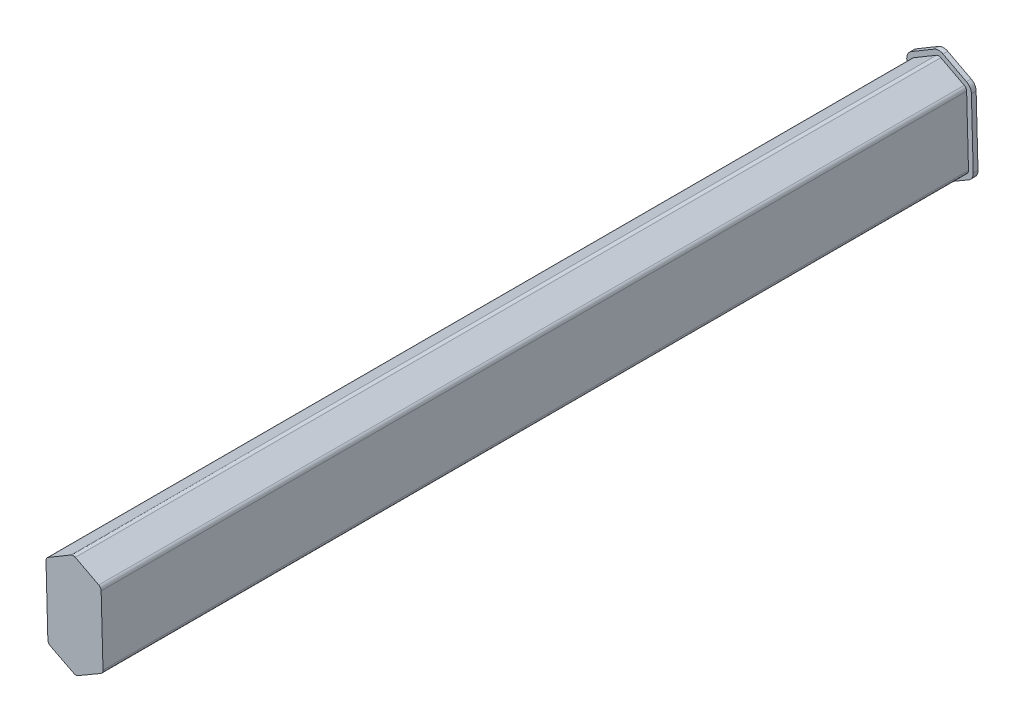
ISO-10303-21;
HEADER;
FILE_DESCRIPTION(('STEP AP214'),'2;1');
FILE_NAME('part.step','',(''),(''),'','','');
FILE_SCHEMA(('AUTOMOTIVE_DESIGN { 1 0 10303 214 1 1 1 1 }'));
ENDSEC;
DATA;
#1=APPLICATION_CONTEXT('core data for automotive mechanical design processes');
#2=APPLICATION_PROTOCOL_DEFINITION('international standard','automotive_design',2000,#1);
#3=PRODUCT_CONTEXT('',#1,'mechanical');
#4=PRODUCT('Part','Part','',(#3));
#5=PRODUCT_RELATED_PRODUCT_CATEGORY('part','',(#4));
#6=PRODUCT_DEFINITION_FORMATION('','',#4);
#7=PRODUCT_DEFINITION_CONTEXT('part definition',#1,'design');
#8=PRODUCT_DEFINITION('design','',#6,#7);
#9=PRODUCT_DEFINITION_SHAPE('','',#8);
#10=(LENGTH_UNIT() NAMED_UNIT(*) SI_UNIT(.MILLI.,.METRE.));
#11=(NAMED_UNIT(*) PLANE_ANGLE_UNIT() SI_UNIT($,.RADIAN.));
#12=(NAMED_UNIT(*) SI_UNIT($,.STERADIAN.) SOLID_ANGLE_UNIT());
#13=UNCERTAINTY_MEASURE_WITH_UNIT(LENGTH_MEASURE(1.E-05),#10,'distance_accuracy_value','');
#14=(GEOMETRIC_REPRESENTATION_CONTEXT(3) GLOBAL_UNCERTAINTY_ASSIGNED_CONTEXT((#13)) GLOBAL_UNIT_ASSIGNED_CONTEXT((#10,
#11,#12)) REPRESENTATION_CONTEXT('',''));
#15=CARTESIAN_POINT('',(0.,0.,0.));
#16=DIRECTION('',(0.,0.,1.));
#17=DIRECTION('',(1.,0.,0.));
#18=AXIS2_PLACEMENT_3D('',#15,#16,#17);
#19=CARTESIAN_POINT('',(229.026929488315,189.242528299791,182.));
#20=DIRECTION('',(0.,0.,-1.));
#21=DIRECTION('',(-1.,0.,0.));
#22=AXIS2_PLACEMENT_3D('',#19,#20,#21);
#23=CYLINDRICAL_SURFACE('',#22,0.95000000000013);
#24=CARTESIAN_POINT('',(229.026929488315,189.242528299791,0.));
#25=DIRECTION('',(0.,0.,1.));
#26=DIRECTION('',(-1.,0.,0.));
#27=AXIS2_PLACEMENT_3D('',#24,#25,#26);
#28=CIRCLE('',#27,0.95000000000013);
#29=CARTESIAN_POINT('',(229.466385632673,190.084774283567,0.));
#30=VERTEX_POINT('',#29);
#31=CARTESIAN_POINT('',(228.542087511655,190.059491124936,0.));
#32=VERTEX_POINT('',#31);
#33=EDGE_CURVE('E217',#30,#32,#28,.T.);
#34=ORIENTED_EDGE('',*,*,#33,.T.);
#35=DIRECTION('',(0.,0.,-1.));
#36=VECTOR('',#35,1.);
#37=CARTESIAN_POINT('',(228.542087511655,190.059491124936,182.));
#38=LINE('',#37,#36);
#39=CARTESIAN_POINT('',(228.542087511655,190.059491124936,182.));
#40=VERTEX_POINT('',#39);
#41=EDGE_CURVE('E11',#40,#32,#38,.T.);
#42=ORIENTED_EDGE('',*,*,#41,.F.);
#43=CARTESIAN_POINT('',(229.026929488315,189.242528299791,182.));
#44=DIRECTION('',(0.,0.,1.));
#45=DIRECTION('',(-1.,0.,0.));
#46=AXIS2_PLACEMENT_3D('',#43,#44,#45);
#47=CIRCLE('',#46,0.95000000000013);
#48=CARTESIAN_POINT('',(229.466385632673,190.084774283567,182.));
#49=VERTEX_POINT('',#48);
#50=EDGE_CURVE('E226',#49,#40,#47,.T.);
#51=ORIENTED_EDGE('',*,*,#50,.F.);
#52=DIRECTION('',(0.,0.,-1.));
#53=VECTOR('',#52,1.);
#54=CARTESIAN_POINT('',(229.466385632673,190.084774283567,182.));
#55=LINE('',#54,#53);
#56=EDGE_CURVE('E249',#49,#30,#55,.T.);
#57=ORIENTED_EDGE('',*,*,#56,.T.);
#58=EDGE_LOOP('',(#34,#42,#51,#57));
#59=FACE_BOUND('',#58,.T.);
#60=ADVANCED_FACE('F36',(#59),#23,.T.);
#61=CARTESIAN_POINT('',(228.542087511655,190.059491124936,182.));
#62=DIRECTION('',(0.510359975431019,-0.85996086857371,0.));
#63=DIRECTION('',(0.85996086857371,0.510359975431019,0.));
#64=AXIS2_PLACEMENT_3D('',#61,#62,#63);
#65=PLANE('',#64);
#66=DIRECTION('',(-0.85996086857371,-0.510359975431019,0.));
#67=VECTOR('',#66,1.);
#68=CARTESIAN_POINT('',(228.542087511655,190.059491124936,0.));
#69=LINE('',#68,#67);
#70=CARTESIAN_POINT('',(223.767778026477,187.226087233435,0.));
#71=VERTEX_POINT('',#70);
#72=EDGE_CURVE('E220',#32,#71,#69,.T.);
#73=ORIENTED_EDGE('',*,*,#72,.T.);
#74=DIRECTION('',(0.,0.,-1.));
#75=VECTOR('',#74,1.);
#76=CARTESIAN_POINT('',(223.767778026477,187.226087233435,182.));
#77=LINE('',#76,#75);
#78=CARTESIAN_POINT('',(223.767778026477,187.226087233435,182.));
#79=VERTEX_POINT('',#78);
#80=EDGE_CURVE('E44',#79,#71,#77,.T.);
#81=ORIENTED_EDGE('',*,*,#80,.F.);
#82=DIRECTION('',(-0.85996086857371,-0.510359975431019,0.));
#83=VECTOR('',#82,1.);
#84=CARTESIAN_POINT('',(228.542087511655,190.059491124936,182.));
#85=LINE('',#84,#83);
#86=EDGE_CURVE('E228',#40,#79,#85,.T.);
#87=ORIENTED_EDGE('',*,*,#86,.F.);
#88=ORIENTED_EDGE('',*,*,#41,.T.);
#89=EDGE_LOOP('',(#73,#81,#87,#88));
#90=FACE_BOUND('',#89,.T.);
#91=ADVANCED_FACE('F318',(#90),#65,.F.);
#92=CARTESIAN_POINT('',(224.252620003137,186.40912440829,182.));
#93=DIRECTION('',(0.,0.,-1.));
#94=DIRECTION('',(-1.,0.,0.));
#95=AXIS2_PLACEMENT_3D('',#92,#93,#94);
#96=CYLINDRICAL_SURFACE('',#95,0.950000000000361);
#97=CARTESIAN_POINT('',(224.252620003137,186.40912440829,0.));
#98=DIRECTION('',(0.,0.,1.));
#99=DIRECTION('',(-1.,0.,0.));
#100=AXIS2_PLACEMENT_3D('',#97,#98,#99);
#101=CIRCLE('',#100,0.950000000000361);
#102=CARTESIAN_POINT('',(223.302975215846,186.383147919479,0.));
#103=VERTEX_POINT('',#102);
#104=EDGE_CURVE('E253',#71,#103,#101,.T.);
#105=ORIENTED_EDGE('',*,*,#104,.T.);
#106=DIRECTION('',(0.,0.,-1.));
#107=VECTOR('',#106,1.);
#108=CARTESIAN_POINT('',(223.302975215846,186.383147919479,182.));
#109=LINE('',#108,#107);
#110=CARTESIAN_POINT('',(223.302975215846,186.383147919479,182.));
#111=VERTEX_POINT('',#110);
#112=EDGE_CURVE('E308',#111,#103,#109,.T.);
#113=ORIENTED_EDGE('',*,*,#112,.F.);
#114=CARTESIAN_POINT('',(224.252620003137,186.40912440829,182.));
#115=DIRECTION('',(0.,0.,1.));
#116=DIRECTION('',(-1.,0.,0.));
#117=AXIS2_PLACEMENT_3D('',#114,#115,#116);
#118=CIRCLE('',#117,0.950000000000361);
#119=EDGE_CURVE('E231',#79,#111,#118,.T.);
#120=ORIENTED_EDGE('',*,*,#119,.F.);
#121=ORIENTED_EDGE('',*,*,#80,.T.);
#122=EDGE_LOOP('',(#105,#113,#120,#121));
#123=FACE_BOUND('',#122,.T.);
#124=ADVANCED_FACE('F314',(#123),#96,.T.);
#125=CARTESIAN_POINT('',(223.302975215846,186.383147919479,182.));
#126=DIRECTION('',(0.999626091885286,0.0273436724334757,0.));
#127=DIRECTION('',(-0.0273436724334757,0.999626091885286,0.));
#128=AXIS2_PLACEMENT_3D('',#125,#126,#127);
#129=PLANE('',#128);
#130=DIRECTION('',(0.0273436724334757,-0.999626091885286,0.));
#131=VECTOR('',#130,1.);
#132=CARTESIAN_POINT('',(223.302975215846,186.383147919479,0.));
#133=LINE('',#132,#131);
#134=CARTESIAN_POINT('',(223.692518777078,172.142269753566,0.));
#135=VERTEX_POINT('',#134);
#136=EDGE_CURVE('E256',#103,#135,#133,.T.);
#137=ORIENTED_EDGE('',*,*,#136,.T.);
#138=DIRECTION('',(0.,0.,-1.));
#139=VECTOR('',#138,1.);
#140=CARTESIAN_POINT('',(223.692518777078,172.142269753566,182.));
#141=LINE('',#140,#139);
#142=CARTESIAN_POINT('',(223.692518777078,172.142269753566,182.));
#143=VERTEX_POINT('',#142);
#144=EDGE_CURVE('E305',#143,#135,#141,.T.);
#145=ORIENTED_EDGE('',*,*,#144,.F.);
#146=DIRECTION('',(0.0273436724334757,-0.999626091885286,0.));
#147=VECTOR('',#146,1.);
#148=CARTESIAN_POINT('',(223.302975215846,186.383147919479,182.));
#149=LINE('',#148,#147);
#150=EDGE_CURVE('E233',#111,#143,#149,.T.);
#151=ORIENTED_EDGE('',*,*,#150,.F.);
#152=ORIENTED_EDGE('',*,*,#112,.T.);
#153=EDGE_LOOP('',(#137,#145,#151,#152));
#154=FACE_BOUND('',#153,.T.);
#155=ADVANCED_FACE('F325',(#154),#129,.F.);
#156=CARTESIAN_POINT('',(224.64216356437,172.168246242378,182.));
#157=DIRECTION('',(0.,0.,-1.));
#158=DIRECTION('',(-1.,0.,0.));
#159=AXIS2_PLACEMENT_3D('',#156,#157,#158);
#160=CYLINDRICAL_SURFACE('',#159,0.950000000000508);
#161=CARTESIAN_POINT('',(224.64216356437,172.168246242378,0.));
#162=DIRECTION('',(0.,0.,1.));
#163=DIRECTION('',(-1.,0.,0.));
#164=AXIS2_PLACEMENT_3D('',#161,#162,#163);
#165=CIRCLE('',#164,0.950000000000508);
#166=CARTESIAN_POINT('',(224.209349737693,171.322567703311,0.));
#167=VERTEX_POINT('',#166);
#168=EDGE_CURVE('E259',#135,#167,#165,.T.);
#169=ORIENTED_EDGE('',*,*,#168,.T.);
#170=DIRECTION('',(0.,0.,-1.));
#171=VECTOR('',#170,1.);
#172=CARTESIAN_POINT('',(224.209349737693,171.322567703311,182.));
#173=LINE('',#172,#171);
#174=CARTESIAN_POINT('',(224.209349737693,171.322567703311,182.));
#175=VERTEX_POINT('',#174);
#176=EDGE_CURVE('E302',#175,#167,#173,.T.);
#177=ORIENTED_EDGE('',*,*,#176,.F.);
#178=CARTESIAN_POINT('',(224.64216356437,172.168246242378,182.));
#179=DIRECTION('',(0.,0.,1.));
#180=DIRECTION('',(-1.,0.,0.));
#181=AXIS2_PLACEMENT_3D('',#178,#179,#180);
#182=CIRCLE('',#181,0.950000000000508);
#183=EDGE_CURVE('E235',#143,#175,#182,.T.);
#184=ORIENTED_EDGE('',*,*,#183,.F.);
#185=ORIENTED_EDGE('',*,*,#144,.T.);
#186=EDGE_LOOP('',(#169,#177,#184,#185));
#187=FACE_BOUND('',#186,.T.);
#188=ADVANCED_FACE('F329',(#187),#160,.T.);
#189=CARTESIAN_POINT('',(224.209349737693,171.322567703311,182.));
#190=DIRECTION('',(0.455593501763797,0.890187935859951,0.));
#191=DIRECTION('',(-0.890187935859952,0.455593501763797,0.));
#192=AXIS2_PLACEMENT_3D('',#189,#190,#191);
#193=PLANE('',#192);
#194=DIRECTION('',(0.890187935859952,-0.455593501763797,0.));
#195=VECTOR('',#194,1.);
#196=CARTESIAN_POINT('',(224.209349737693,171.322567703311,0.));
#197=LINE('',#196,#195);
#198=CARTESIAN_POINT('',(229.130051641335,168.804178359772,0.));
#199=VERTEX_POINT('',#198);
#200=EDGE_CURVE('E262',#167,#199,#197,.T.);
#201=ORIENTED_EDGE('',*,*,#200,.T.);
#202=DIRECTION('',(0.,0.,-1.));
#203=VECTOR('',#202,1.);
#204=CARTESIAN_POINT('',(229.130051641335,168.804178359772,182.));
#205=LINE('',#204,#203);
#206=CARTESIAN_POINT('',(229.130051641335,168.804178359772,182.));
#207=VERTEX_POINT('',#206);
#208=EDGE_CURVE('E299',#207,#199,#205,.T.);
#209=ORIENTED_EDGE('',*,*,#208,.F.);
#210=DIRECTION('',(0.890187935859952,-0.455593501763797,0.));
#211=VECTOR('',#210,1.);
#212=CARTESIAN_POINT('',(224.209349737693,171.322567703311,182.));
#213=LINE('',#212,#211);
#214=EDGE_CURVE('E237',#175,#207,#213,.T.);
#215=ORIENTED_EDGE('',*,*,#214,.F.);
#216=ORIENTED_EDGE('',*,*,#176,.T.);
#217=EDGE_LOOP('',(#201,#209,#215,#216));
#218=FACE_BOUND('',#217,.T.);
#219=ADVANCED_FACE('F359',(#218),#193,.F.);
#220=CARTESIAN_POINT('',(229.56286546801,169.64985689884,182.));
#221=DIRECTION('',(0.,0.,-1.));
#222=DIRECTION('',(-1.,0.,0.));
#223=AXIS2_PLACEMENT_3D('',#220,#221,#222);
#224=CYLINDRICAL_SURFACE('',#223,0.950000000000251);
#225=CARTESIAN_POINT('',(229.56286546801,169.64985689884,0.));
#226=DIRECTION('',(0.,0.,1.));
#227=DIRECTION('',(1.,0.,0.));
#228=AXIS2_PLACEMENT_3D('',#225,#226,#227);
#229=CIRCLE('',#228,0.950000000000251);
#230=CARTESIAN_POINT('',(230.041262706742,168.829103536388,0.));
#231=VERTEX_POINT('',#230);
#232=EDGE_CURVE('E265',#199,#231,#229,.T.);
#233=ORIENTED_EDGE('',*,*,#232,.T.);
#234=DIRECTION('',(0.,0.,-1.));
#235=VECTOR('',#234,1.);
#236=CARTESIAN_POINT('',(230.041262706742,168.829103536388,182.));
#237=LINE('',#236,#235);
#238=CARTESIAN_POINT('',(230.041262706742,168.829103536388,182.));
#239=VERTEX_POINT('',#238);
#240=EDGE_CURVE('E296',#239,#231,#237,.T.);
#241=ORIENTED_EDGE('',*,*,#240,.F.);
#242=CARTESIAN_POINT('',(229.56286546801,169.64985689884,182.));
#243=DIRECTION('',(0.,0.,1.));
#244=DIRECTION('',(1.,0.,0.));
#245=AXIS2_PLACEMENT_3D('',#242,#243,#244);
#246=CIRCLE('',#245,0.950000000000251);
#247=EDGE_CURVE('E239',#207,#239,#246,.T.);
#248=ORIENTED_EDGE('',*,*,#247,.F.);
#249=ORIENTED_EDGE('',*,*,#208,.T.);
#250=EDGE_LOOP('',(#233,#241,#248,#249));
#251=FACE_BOUND('',#250,.T.);
#252=ADVANCED_FACE('F356',(#251),#224,.T.);
#253=CARTESIAN_POINT('',(234.816933894388,171.612726502531,182.));
#254=DIRECTION('',(-0.503576040769522,0.863950907843086,0.));
#255=DIRECTION('',(-0.863950907843086,-0.503576040769522,0.));
#256=AXIS2_PLACEMENT_3D('',#253,#254,#255);
#257=PLANE('',#256);
#258=DIRECTION('',(0.863950907843086,0.503576040769522,0.));
#259=VECTOR('',#258,1.);
#260=CARTESIAN_POINT('',(234.816933894388,171.612726502531,0.));
#261=LINE('',#260,#259);
#262=CARTESIAN_POINT('',(234.816933894388,171.612726502531,0.));
#263=VERTEX_POINT('',#262);
#264=EDGE_CURVE('E268',#231,#263,#261,.T.);
#265=ORIENTED_EDGE('',*,*,#264,.T.);
#266=DIRECTION('',(0.,0.,-1.));
#267=VECTOR('',#266,1.);
#268=CARTESIAN_POINT('',(234.816933894388,171.612726502531,182.));
#269=LINE('',#268,#267);
#270=CARTESIAN_POINT('',(234.816933894388,171.612726502531,182.));
#271=VERTEX_POINT('',#270);
#272=EDGE_CURVE('E293',#271,#263,#269,.T.);
#273=ORIENTED_EDGE('',*,*,#272,.F.);
#274=DIRECTION('',(0.863950907843086,0.503576040769522,0.));
#275=VECTOR('',#274,1.);
#276=CARTESIAN_POINT('',(234.816933894388,171.612726502531,182.));
#277=LINE('',#276,#275);
#278=EDGE_CURVE('E241',#239,#271,#277,.T.);
#279=ORIENTED_EDGE('',*,*,#278,.F.);
#280=ORIENTED_EDGE('',*,*,#240,.T.);
#281=EDGE_LOOP('',(#265,#273,#279,#280));
#282=FACE_BOUND('',#281,.T.);
#283=ADVANCED_FACE('F353',(#282),#257,.F.);
#284=CARTESIAN_POINT('',(234.338536655657,172.433479864982,182.));
#285=DIRECTION('',(0.,0.,-1.));
#286=DIRECTION('',(-1.,0.,0.));
#287=AXIS2_PLACEMENT_3D('',#284,#285,#286);
#288=CYLINDRICAL_SURFACE('',#287,0.950000000000011);
#289=CARTESIAN_POINT('',(234.338536655657,172.433479864982,0.));
#290=DIRECTION('',(0.,0.,1.));
#291=DIRECTION('',(-1.,0.,0.));
#292=AXIS2_PLACEMENT_3D('',#289,#290,#291);
#293=CIRCLE('',#292,0.950000000000011);
#294=CARTESIAN_POINT('',(235.288181442948,172.459456353794,0.));
#295=VERTEX_POINT('',#294);
#296=EDGE_CURVE('E271',#263,#295,#293,.T.);
#297=ORIENTED_EDGE('',*,*,#296,.T.);
#298=DIRECTION('',(0.,0.,-1.));
#299=VECTOR('',#298,1.);
#300=CARTESIAN_POINT('',(235.288181442948,172.459456353794,182.));
#301=LINE('',#300,#299);
#302=CARTESIAN_POINT('',(235.288181442948,172.459456353794,182.));
#303=VERTEX_POINT('',#302);
#304=EDGE_CURVE('E290',#303,#295,#301,.T.);
#305=ORIENTED_EDGE('',*,*,#304,.F.);
#306=CARTESIAN_POINT('',(234.338536655657,172.433479864982,182.));
#307=DIRECTION('',(0.,0.,1.));
#308=DIRECTION('',(-1.,0.,0.));
#309=AXIS2_PLACEMENT_3D('',#306,#307,#308);
#310=CIRCLE('',#309,0.950000000000011);
#311=EDGE_CURVE('E243',#271,#303,#310,.T.);
#312=ORIENTED_EDGE('',*,*,#311,.F.);
#313=ORIENTED_EDGE('',*,*,#272,.T.);
#314=EDGE_LOOP('',(#297,#305,#312,#313));
#315=FACE_BOUND('',#314,.T.);
#316=ADVANCED_FACE('F348',(#315),#288,.T.);
#317=CARTESIAN_POINT('',(234.898637881716,186.700334519707,182.));
#318=DIRECTION('',(-0.999626091885286,-0.0273436724334835,0.));
#319=DIRECTION('',(0.0273436724334835,-0.999626091885286,0.));
#320=AXIS2_PLACEMENT_3D('',#317,#318,#319);
#321=PLANE('',#320);
#322=DIRECTION('',(-0.0273436724334835,0.999626091885286,0.));
#323=VECTOR('',#322,1.);
#324=CARTESIAN_POINT('',(234.898637881716,186.700334519707,0.));
#325=LINE('',#324,#323);
#326=CARTESIAN_POINT('',(234.898637881716,186.700334519707,0.));
#327=VERTEX_POINT('',#326);
#328=EDGE_CURVE('E274',#295,#327,#325,.T.);
#329=ORIENTED_EDGE('',*,*,#328,.T.);
#330=DIRECTION('',(0.,0.,-1.));
#331=VECTOR('',#330,1.);
#332=CARTESIAN_POINT('',(234.898637881716,186.700334519707,182.));
#333=LINE('',#332,#331);
#334=CARTESIAN_POINT('',(234.898637881716,186.700334519707,182.));
#335=VERTEX_POINT('',#334);
#336=EDGE_CURVE('E287',#335,#327,#333,.T.);
#337=ORIENTED_EDGE('',*,*,#336,.F.);
#338=DIRECTION('',(-0.0273436724334835,0.999626091885286,0.));
#339=VECTOR('',#338,1.);
#340=CARTESIAN_POINT('',(234.898637881716,186.700334519707,182.));
#341=LINE('',#340,#339);
#342=EDGE_CURVE('E245',#303,#335,#341,.T.);
#343=ORIENTED_EDGE('',*,*,#342,.F.);
#344=ORIENTED_EDGE('',*,*,#304,.T.);
#345=EDGE_LOOP('',(#329,#337,#343,#344));
#346=FACE_BOUND('',#345,.T.);
#347=ADVANCED_FACE('F345',(#346),#321,.F.);
#348=CARTESIAN_POINT('',(233.948993094425,186.674358030895,182.));
#349=DIRECTION('',(0.,0.,-1.));
#350=DIRECTION('',(-1.,0.,0.));
#351=AXIS2_PLACEMENT_3D('',#348,#349,#350);
#352=CYLINDRICAL_SURFACE('',#351,0.949999999999995);
#353=CARTESIAN_POINT('',(233.948993094425,186.674358030895,0.));
#354=DIRECTION('',(0.,0.,1.));
#355=DIRECTION('',(-1.,0.,0.));
#356=AXIS2_PLACEMENT_3D('',#353,#354,#355);
#357=CIRCLE('',#356,0.949999999999995);
#358=CARTESIAN_POINT('',(234.388449238783,187.51660401467,0.));
#359=VERTEX_POINT('',#358);
#360=EDGE_CURVE('E277',#327,#359,#357,.T.);
#361=ORIENTED_EDGE('',*,*,#360,.T.);
#362=DIRECTION('',(0.,0.,-1.));
#363=VECTOR('',#362,1.);
#364=CARTESIAN_POINT('',(234.388449238783,187.51660401467,182.));
#365=LINE('',#364,#363);
#366=CARTESIAN_POINT('',(234.388449238783,187.51660401467,182.));
#367=VERTEX_POINT('',#366);
#368=EDGE_CURVE('E284',#367,#359,#365,.T.);
#369=ORIENTED_EDGE('',*,*,#368,.F.);
#370=CARTESIAN_POINT('',(233.948993094425,186.674358030895,182.));
#371=DIRECTION('',(0.,0.,1.));
#372=DIRECTION('',(-1.,0.,0.));
#373=AXIS2_PLACEMENT_3D('',#370,#371,#372);
#374=CIRCLE('',#373,0.949999999999995);
#375=EDGE_CURVE('E247',#335,#367,#374,.T.);
#376=ORIENTED_EDGE('',*,*,#375,.F.);
#377=ORIENTED_EDGE('',*,*,#336,.T.);
#378=EDGE_LOOP('',(#361,#369,#376,#377));
#379=FACE_BOUND('',#378,.T.);
#380=ADVANCED_FACE('F340',(#379),#352,.T.);
#381=CARTESIAN_POINT('',(229.466385632673,190.084774283567,182.));
#382=DIRECTION('',(-0.462585415114355,-0.88657471976336,0.));
#383=DIRECTION('',(0.88657471976336,-0.462585415114355,0.));
#384=AXIS2_PLACEMENT_3D('',#381,#382,#383);
#385=PLANE('',#384);
#386=DIRECTION('',(-0.88657471976336,0.462585415114355,0.));
#387=VECTOR('',#386,1.);
#388=CARTESIAN_POINT('',(229.466385632673,190.084774283567,0.));
#389=LINE('',#388,#387);
#390=EDGE_CURVE('E229',#359,#30,#389,.T.);
#391=ORIENTED_EDGE('',*,*,#390,.T.);
#392=ORIENTED_EDGE('',*,*,#56,.F.);
#393=DIRECTION('',(-0.88657471976336,0.462585415114355,0.));
#394=VECTOR('',#393,1.);
#395=CARTESIAN_POINT('',(229.466385632673,190.084774283567,182.));
#396=LINE('',#395,#394);
#397=EDGE_CURVE('E51',#367,#49,#396,.T.);
#398=ORIENTED_EDGE('',*,*,#397,.F.);
#399=ORIENTED_EDGE('',*,*,#368,.T.);
#400=EDGE_LOOP('',(#391,#392,#398,#399));
#401=FACE_BOUND('',#400,.T.);
#402=ADVANCED_FACE('F337',(#401),#385,.F.);
#403=CARTESIAN_POINT('',(229.026929488315,189.242528299791,182.));
#404=DIRECTION('',(0.,0.,-1.));
#405=DIRECTION('',(-1.,0.,0.));
#406=AXIS2_PLACEMENT_3D('',#403,#404,#405);
#407=PLANE('',#406);
#408=ORIENTED_EDGE('',*,*,#50,.T.);
#409=ORIENTED_EDGE('',*,*,#86,.T.);
#410=ORIENTED_EDGE('',*,*,#119,.T.);
#411=ORIENTED_EDGE('',*,*,#150,.T.);
#412=ORIENTED_EDGE('',*,*,#183,.T.);
#413=ORIENTED_EDGE('',*,*,#214,.T.);
#414=ORIENTED_EDGE('',*,*,#247,.T.);
#415=ORIENTED_EDGE('',*,*,#278,.T.);
#416=ORIENTED_EDGE('',*,*,#311,.T.);
#417=ORIENTED_EDGE('',*,*,#342,.T.);
#418=ORIENTED_EDGE('',*,*,#375,.T.);
#419=ORIENTED_EDGE('',*,*,#397,.T.);
#420=EDGE_LOOP('',(#408,#409,#410,#411,#412,#413,#414,#415,#416,#417,#418,#419));
#421=FACE_BOUND('',#420,.T.);
#422=ADVANCED_FACE('F332',(#421),#407,.F.);
#423=CARTESIAN_POINT('',(229.026929488315,189.242528299791,-1.));
#424=DIRECTION('',(0.,0.,1.));
#425=DIRECTION('',(1.,0.,0.));
#426=AXIS2_PLACEMENT_3D('',#423,#424,#425);
#427=CYLINDRICAL_SURFACE('',#426,1.95000000000012);
#428=CARTESIAN_POINT('',(229.026929488315,189.242528299791,0.));
#429=DIRECTION('',(0.,0.,-1.));
#430=DIRECTION('',(-1.,0.,0.));
#431=AXIS2_PLACEMENT_3D('',#428,#429,#430);
#432=CIRCLE('',#431,1.95000000000012);
#433=CARTESIAN_POINT('',(228.031727536224,190.91945199351,0.));
#434=VERTEX_POINT('',#433);
#435=CARTESIAN_POINT('',(229.928971047788,190.97134900333,0.));
#436=VERTEX_POINT('',#435);
#437=EDGE_CURVE('E216',#434,#436,#432,.T.);
#438=ORIENTED_EDGE('',*,*,#437,.T.);
#439=DIRECTION('',(0.,0.,1.));
#440=VECTOR('',#439,1.);
#441=CARTESIAN_POINT('',(229.928971047788,190.97134900333,-1.));
#442=LINE('',#441,#440);
#443=CARTESIAN_POINT('',(229.928971047788,190.97134900333,-1.));
#444=VERTEX_POINT('',#443);
#445=EDGE_CURVE('E196',#444,#436,#442,.T.);
#446=ORIENTED_EDGE('',*,*,#445,.F.);
#447=CARTESIAN_POINT('',(229.026929488315,189.242528299791,-1.));
#448=DIRECTION('',(0.,0.,-1.));
#449=DIRECTION('',(-1.,0.,0.));
#450=AXIS2_PLACEMENT_3D('',#447,#448,#449);
#451=CIRCLE('',#450,1.95000000000012);
#452=CARTESIAN_POINT('',(228.031727536224,190.91945199351,-1.));
#453=VERTEX_POINT('',#452);
#454=EDGE_CURVE('E203',#453,#444,#451,.T.);
#455=ORIENTED_EDGE('',*,*,#454,.F.);
#456=DIRECTION('',(0.,0.,1.));
#457=VECTOR('',#456,1.);
#458=CARTESIAN_POINT('',(228.031727536224,190.91945199351,-1.));
#459=LINE('',#458,#457);
#460=EDGE_CURVE('E596',#453,#434,#459,.T.);
#461=ORIENTED_EDGE('',*,*,#460,.T.);
#462=EDGE_LOOP('',(#438,#446,#455,#461));
#463=FACE_BOUND('',#462,.T.);
#464=ADVANCED_FACE('F214',(#463),#427,.T.);
#465=CARTESIAN_POINT('',(229.928971047788,190.97134900333,-1.));
#466=DIRECTION('',(-0.462585415114331,-0.886574719763372,0.));
#467=DIRECTION('',(0.886574719763372,-0.462585415114331,0.));
#468=AXIS2_PLACEMENT_3D('',#465,#466,#467);
#469=PLANE('',#468);
#470=DIRECTION('',(0.886574719763372,-0.462585415114331,0.));
#471=VECTOR('',#470,1.);
#472=CARTESIAN_POINT('',(229.928971047788,190.97134900333,0.));
#473=LINE('',#472,#471);
#474=CARTESIAN_POINT('',(234.851034653898,188.403178734434,0.));
#475=VERTEX_POINT('',#474);
#476=EDGE_CURVE('E604',#436,#475,#473,.T.);
#477=ORIENTED_EDGE('',*,*,#476,.T.);
#478=DIRECTION('',(0.,0.,1.));
#479=VECTOR('',#478,1.);
#480=CARTESIAN_POINT('',(234.851034653898,188.403178734434,-1.));
#481=LINE('',#480,#479);
#482=CARTESIAN_POINT('',(234.851034653898,188.403178734434,-1.));
#483=VERTEX_POINT('',#482);
#484=EDGE_CURVE('E199',#483,#475,#481,.T.);
#485=ORIENTED_EDGE('',*,*,#484,.F.);
#486=DIRECTION('',(0.886574719763372,-0.462585415114331,0.));
#487=VECTOR('',#486,1.);
#488=CARTESIAN_POINT('',(229.928971047788,190.97134900333,-1.));
#489=LINE('',#488,#487);
#490=EDGE_CURVE('E192',#444,#483,#489,.T.);
#491=ORIENTED_EDGE('',*,*,#490,.F.);
#492=ORIENTED_EDGE('',*,*,#445,.T.);
#493=EDGE_LOOP('',(#477,#485,#491,#492));
#494=FACE_BOUND('',#493,.T.);
#495=ADVANCED_FACE('F194',(#494),#469,.F.);
#496=CARTESIAN_POINT('',(233.948993094425,186.674358030895,-1.));
#497=DIRECTION('',(0.,0.,1.));
#498=DIRECTION('',(1.,0.,0.));
#499=AXIS2_PLACEMENT_3D('',#496,#497,#498);
#500=CYLINDRICAL_SURFACE('',#499,1.94999999999999);
#501=CARTESIAN_POINT('',(233.948993094425,186.674358030895,0.));
#502=DIRECTION('',(0.,0.,-1.));
#503=DIRECTION('',(-1.,0.,0.));
#504=AXIS2_PLACEMENT_3D('',#501,#502,#503);
#505=CIRCLE('',#504,1.94999999999999);
#506=CARTESIAN_POINT('',(235.898263973601,186.72767819214,0.));
#507=VERTEX_POINT('',#506);
#508=EDGE_CURVE('E606',#475,#507,#505,.T.);
#509=ORIENTED_EDGE('',*,*,#508,.T.);
#510=DIRECTION('',(0.,0.,1.));
#511=VECTOR('',#510,1.);
#512=CARTESIAN_POINT('',(235.898263973601,186.72767819214,-1.));
#513=LINE('',#512,#511);
#514=CARTESIAN_POINT('',(235.898263973601,186.72767819214,-1.));
#515=VERTEX_POINT('',#514);
#516=EDGE_CURVE('E222',#515,#507,#513,.T.);
#517=ORIENTED_EDGE('',*,*,#516,.F.);
#518=CARTESIAN_POINT('',(233.948993094425,186.674358030895,-1.));
#519=DIRECTION('',(0.,0.,-1.));
#520=DIRECTION('',(-1.,0.,0.));
#521=AXIS2_PLACEMENT_3D('',#518,#519,#520);
#522=CIRCLE('',#521,1.94999999999999);
#523=EDGE_CURVE('E202',#483,#515,#522,.T.);
#524=ORIENTED_EDGE('',*,*,#523,.F.);
#525=ORIENTED_EDGE('',*,*,#484,.T.);
#526=EDGE_LOOP('',(#509,#517,#524,#525));
#527=FACE_BOUND('',#526,.T.);
#528=ADVANCED_FACE('F455',(#527),#500,.T.);
#529=CARTESIAN_POINT('',(235.898263973601,186.72767819214,-1.));
#530=DIRECTION('',(-0.999626091885286,-0.0273436724334835,0.));
#531=DIRECTION('',(0.0273436724334835,-0.999626091885286,0.));
#532=AXIS2_PLACEMENT_3D('',#529,#530,#531);
#533=PLANE('',#532);
#534=DIRECTION('',(0.0273436724334835,-0.999626091885286,0.));
#535=VECTOR('',#534,1.);
#536=CARTESIAN_POINT('',(235.898263973601,186.72767819214,0.));
#537=LINE('',#536,#535);
#538=CARTESIAN_POINT('',(236.287807534833,172.486800026228,0.));
#539=VERTEX_POINT('',#538);
#540=EDGE_CURVE('E612',#507,#539,#537,.T.);
#541=ORIENTED_EDGE('',*,*,#540,.T.);
#542=DIRECTION('',(0.,0.,1.));
#543=VECTOR('',#542,1.);
#544=CARTESIAN_POINT('',(236.287807534833,172.486800026228,-1.));
#545=LINE('',#544,#543);
#546=CARTESIAN_POINT('',(236.287807534833,172.486800026228,-1.));
#547=VERTEX_POINT('',#546);
#548=EDGE_CURVE('E646',#547,#539,#545,.T.);
#549=ORIENTED_EDGE('',*,*,#548,.F.);
#550=DIRECTION('',(0.0273436724334835,-0.999626091885286,0.));
#551=VECTOR('',#550,1.);
#552=CARTESIAN_POINT('',(235.898263973601,186.72767819214,-1.));
#553=LINE('',#552,#551);
#554=EDGE_CURVE('E653',#515,#547,#553,.T.);
#555=ORIENTED_EDGE('',*,*,#554,.F.);
#556=ORIENTED_EDGE('',*,*,#516,.T.);
#557=EDGE_LOOP('',(#541,#549,#555,#556));
#558=FACE_BOUND('',#557,.T.);
#559=ADVANCED_FACE('F464',(#558),#533,.F.);
#560=CARTESIAN_POINT('',(234.338536655657,172.433479864982,-1.));
#561=DIRECTION('',(0.,0.,1.));
#562=DIRECTION('',(1.,0.,0.));
#563=AXIS2_PLACEMENT_3D('',#560,#561,#562);
#564=CYLINDRICAL_SURFACE('',#563,1.95);
#565=CARTESIAN_POINT('',(234.338536655657,172.433479864982,0.));
#566=DIRECTION('',(0.,0.,-1.));
#567=DIRECTION('',(-1.,0.,0.));
#568=AXIS2_PLACEMENT_3D('',#565,#566,#567);
#569=CIRCLE('',#568,1.95);
#570=CARTESIAN_POINT('',(235.320509935158,170.748775594688,0.));
#571=VERTEX_POINT('',#570);
#572=EDGE_CURVE('E614',#539,#571,#569,.T.);
#573=ORIENTED_EDGE('',*,*,#572,.T.);
#574=DIRECTION('',(0.,0.,1.));
#575=VECTOR('',#574,1.);
#576=CARTESIAN_POINT('',(235.320509935158,170.748775594688,-1.));
#577=LINE('',#576,#575);
#578=CARTESIAN_POINT('',(235.320509935158,170.748775594688,-1.));
#579=VERTEX_POINT('',#578);
#580=EDGE_CURVE('E643',#579,#571,#577,.T.);
#581=ORIENTED_EDGE('',*,*,#580,.F.);
#582=CARTESIAN_POINT('',(234.338536655657,172.433479864982,-1.));
#583=DIRECTION('',(0.,0.,-1.));
#584=DIRECTION('',(-1.,0.,0.));
#585=AXIS2_PLACEMENT_3D('',#582,#583,#584);
#586=CIRCLE('',#585,1.95);
#587=EDGE_CURVE('E664',#547,#579,#586,.T.);
#588=ORIENTED_EDGE('',*,*,#587,.F.);
#589=ORIENTED_EDGE('',*,*,#548,.T.);
#590=EDGE_LOOP('',(#573,#581,#588,#589));
#591=FACE_BOUND('',#590,.T.);
#592=ADVANCED_FACE('F474',(#591),#564,.T.);
#593=CARTESIAN_POINT('',(235.320509935158,170.748775594688,-1.));
#594=DIRECTION('',(-0.503576040769526,0.863950907843084,0.));
#595=DIRECTION('',(-0.863950907843084,-0.503576040769526,0.));
#596=AXIS2_PLACEMENT_3D('',#593,#594,#595);
#597=PLANE('',#596);
#598=DIRECTION('',(-0.863950907843084,-0.503576040769526,0.));
#599=VECTOR('',#598,1.);
#600=CARTESIAN_POINT('',(235.320509935158,170.748775594688,0.));
#601=LINE('',#600,#599);
#602=CARTESIAN_POINT('',(230.544838747511,167.965152628545,0.));
#603=VERTEX_POINT('',#602);
#604=EDGE_CURVE('E616',#571,#603,#601,.T.);
#605=ORIENTED_EDGE('',*,*,#604,.T.);
#606=DIRECTION('',(0.,0.,1.));
#607=VECTOR('',#606,1.);
#608=CARTESIAN_POINT('',(230.544838747511,167.965152628545,-1.));
#609=LINE('',#608,#607);
#610=CARTESIAN_POINT('',(230.544838747511,167.965152628545,-1.));
#611=VERTEX_POINT('',#610);
#612=EDGE_CURVE('E640',#611,#603,#609,.T.);
#613=ORIENTED_EDGE('',*,*,#612,.F.);
#614=DIRECTION('',(-0.863950907843084,-0.503576040769526,0.));
#615=VECTOR('',#614,1.);
#616=CARTESIAN_POINT('',(235.320509935158,170.748775594688,-1.));
#617=LINE('',#616,#615);
#618=EDGE_CURVE('E661',#579,#611,#617,.T.);
#619=ORIENTED_EDGE('',*,*,#618,.F.);
#620=ORIENTED_EDGE('',*,*,#580,.T.);
#621=EDGE_LOOP('',(#605,#613,#619,#620));
#622=FACE_BOUND('',#621,.T.);
#623=ADVANCED_FACE('F484',(#622),#597,.F.);
#624=CARTESIAN_POINT('',(229.56286546801,169.64985689884,-1.));
#625=DIRECTION('',(0.,0.,1.));
#626=DIRECTION('',(1.,0.,0.));
#627=AXIS2_PLACEMENT_3D('',#624,#625,#626);
#628=CYLINDRICAL_SURFACE('',#627,1.95000000000031);
#629=CARTESIAN_POINT('',(229.56286546801,169.64985689884,0.));
#630=DIRECTION('',(0.,0.,-1.));
#631=DIRECTION('',(-1.,0.,0.));
#632=AXIS2_PLACEMENT_3D('',#629,#630,#631);
#633=CIRCLE('',#632,1.95000000000031);
#634=CARTESIAN_POINT('',(228.674458139571,167.913990423912,0.));
#635=VERTEX_POINT('',#634);
#636=EDGE_CURVE('E618',#603,#635,#633,.T.);
#637=ORIENTED_EDGE('',*,*,#636,.T.);
#638=DIRECTION('',(0.,0.,1.));
#639=VECTOR('',#638,1.);
#640=CARTESIAN_POINT('',(228.674458139571,167.913990423912,-1.));
#641=LINE('',#640,#639);
#642=CARTESIAN_POINT('',(228.674458139571,167.913990423912,-1.));
#643=VERTEX_POINT('',#642);
#644=EDGE_CURVE('E637',#643,#635,#641,.T.);
#645=ORIENTED_EDGE('',*,*,#644,.F.);
#646=CARTESIAN_POINT('',(229.56286546801,169.64985689884,-1.));
#647=DIRECTION('',(0.,0.,-1.));
#648=DIRECTION('',(-1.,0.,0.));
#649=AXIS2_PLACEMENT_3D('',#646,#647,#648);
#650=CIRCLE('',#649,1.95000000000031);
#651=EDGE_CURVE('E663',#611,#643,#650,.T.);
#652=ORIENTED_EDGE('',*,*,#651,.F.);
#653=ORIENTED_EDGE('',*,*,#612,.T.);
#654=EDGE_LOOP('',(#637,#645,#652,#653));
#655=FACE_BOUND('',#654,.T.);
#656=ADVANCED_FACE('F494',(#655),#628,.T.);
#657=CARTESIAN_POINT('',(228.674458139571,167.913990423912,-1.));
#658=DIRECTION('',(0.455593501763819,0.89018793585994,0.));
#659=DIRECTION('',(-0.890187935859941,0.455593501763819,0.));
#660=AXIS2_PLACEMENT_3D('',#657,#658,#659);
#661=PLANE('',#660);
#662=DIRECTION('',(-0.89018793585994,0.455593501763819,0.));
#663=VECTOR('',#662,1.);
#664=CARTESIAN_POINT('',(228.674458139571,167.913990423912,0.));
#665=LINE('',#664,#663);
#666=CARTESIAN_POINT('',(223.753756235929,170.432379767451,0.));
#667=VERTEX_POINT('',#666);
#668=EDGE_CURVE('E620',#635,#667,#665,.T.);
#669=ORIENTED_EDGE('',*,*,#668,.T.);
#670=DIRECTION('',(0.,0.,1.));
#671=VECTOR('',#670,1.);
#672=CARTESIAN_POINT('',(223.753756235929,170.432379767451,-1.));
#673=LINE('',#672,#671);
#674=CARTESIAN_POINT('',(223.753756235929,170.432379767451,-1.));
#675=VERTEX_POINT('',#674);
#676=EDGE_CURVE('E634',#675,#667,#673,.T.);
#677=ORIENTED_EDGE('',*,*,#676,.F.);
#678=DIRECTION('',(-0.89018793585994,0.455593501763819,0.));
#679=VECTOR('',#678,1.);
#680=CARTESIAN_POINT('',(228.674458139571,167.913990423912,-1.));
#681=LINE('',#680,#679);
#682=EDGE_CURVE('E666',#643,#675,#681,.T.);
#683=ORIENTED_EDGE('',*,*,#682,.F.);
#684=ORIENTED_EDGE('',*,*,#644,.T.);
#685=EDGE_LOOP('',(#669,#677,#683,#684));
#686=FACE_BOUND('',#685,.T.);
#687=ADVANCED_FACE('F504',(#686),#661,.F.);
#688=CARTESIAN_POINT('',(224.64216356437,172.168246242378,-1.));
#689=DIRECTION('',(0.,0.,1.));
#690=DIRECTION('',(1.,0.,0.));
#691=AXIS2_PLACEMENT_3D('',#688,#689,#690);
#692=CYLINDRICAL_SURFACE('',#691,1.95000000000044);
#693=CARTESIAN_POINT('',(224.64216356437,172.168246242378,0.));
#694=DIRECTION('',(0.,0.,-1.));
#695=DIRECTION('',(-1.,0.,0.));
#696=AXIS2_PLACEMENT_3D('',#693,#694,#695);
#697=CIRCLE('',#696,1.95000000000044);
#698=CARTESIAN_POINT('',(222.692892685193,172.114926081133,0.));
#699=VERTEX_POINT('',#698);
#700=EDGE_CURVE('E622',#667,#699,#697,.T.);
#701=ORIENTED_EDGE('',*,*,#700,.T.);
#702=DIRECTION('',(0.,0.,1.));
#703=VECTOR('',#702,1.);
#704=CARTESIAN_POINT('',(222.692892685193,172.114926081133,-1.));
#705=LINE('',#704,#703);
#706=CARTESIAN_POINT('',(222.692892685193,172.114926081133,-1.));
#707=VERTEX_POINT('',#706);
#708=EDGE_CURVE('E631',#707,#699,#705,.T.);
#709=ORIENTED_EDGE('',*,*,#708,.F.);
#710=CARTESIAN_POINT('',(224.64216356437,172.168246242378,-1.));
#711=DIRECTION('',(0.,0.,-1.));
#712=DIRECTION('',(-1.,0.,0.));
#713=AXIS2_PLACEMENT_3D('',#710,#711,#712);
#714=CIRCLE('',#713,1.95000000000044);
#715=EDGE_CURVE('E672',#675,#707,#714,.T.);
#716=ORIENTED_EDGE('',*,*,#715,.F.);
#717=ORIENTED_EDGE('',*,*,#676,.T.);
#718=EDGE_LOOP('',(#701,#709,#716,#717));
#719=FACE_BOUND('',#718,.T.);
#720=ADVANCED_FACE('F514',(#719),#692,.T.);
#721=CARTESIAN_POINT('',(222.692892685193,172.114926081133,-1.));
#722=DIRECTION('',(0.999626091885286,0.0273436724334839,0.));
#723=DIRECTION('',(-0.0273436724334839,0.999626091885286,0.));
#724=AXIS2_PLACEMENT_3D('',#721,#722,#723);
#725=PLANE('',#724);
#726=DIRECTION('',(-0.0273436724334839,0.999626091885286,0.));
#727=VECTOR('',#726,1.);
#728=CARTESIAN_POINT('',(222.692892685193,172.114926081133,0.));
#729=LINE('',#728,#727);
#730=CARTESIAN_POINT('',(222.303349123961,186.355804247045,0.));
#731=VERTEX_POINT('',#730);
#732=EDGE_CURVE('E624',#699,#731,#729,.T.);
#733=ORIENTED_EDGE('',*,*,#732,.T.);
#734=DIRECTION('',(0.,0.,1.));
#735=VECTOR('',#734,1.);
#736=CARTESIAN_POINT('',(222.303349123961,186.355804247045,-1.));
#737=LINE('',#736,#735);
#738=CARTESIAN_POINT('',(222.303349123961,186.355804247045,-1.));
#739=VERTEX_POINT('',#738);
#740=EDGE_CURVE('E628',#739,#731,#737,.T.);
#741=ORIENTED_EDGE('',*,*,#740,.F.);
#742=DIRECTION('',(-0.0273436724334839,0.999626091885286,0.));
#743=VECTOR('',#742,1.);
#744=CARTESIAN_POINT('',(222.692892685193,172.114926081133,-1.));
#745=LINE('',#744,#743);
#746=EDGE_CURVE('E674',#707,#739,#745,.T.);
#747=ORIENTED_EDGE('',*,*,#746,.F.);
#748=ORIENTED_EDGE('',*,*,#708,.T.);
#749=EDGE_LOOP('',(#733,#741,#747,#748));
#750=FACE_BOUND('',#749,.T.);
#751=ADVANCED_FACE('F524',(#750),#725,.F.);
#752=CARTESIAN_POINT('',(224.252620003137,186.40912440829,-1.));
#753=DIRECTION('',(0.,0.,1.));
#754=DIRECTION('',(1.,0.,0.));
#755=AXIS2_PLACEMENT_3D('',#752,#753,#754);
#756=CYLINDRICAL_SURFACE('',#755,1.95000000000043);
#757=CARTESIAN_POINT('',(224.252620003137,186.40912440829,0.));
#758=DIRECTION('',(0.,0.,-1.));
#759=DIRECTION('',(-1.,0.,0.));
#760=AXIS2_PLACEMENT_3D('',#757,#758,#759);
#761=CIRCLE('',#760,1.95000000000043);
#762=CARTESIAN_POINT('',(223.257418051045,188.086048102009,0.));
#763=VERTEX_POINT('',#762);
#764=EDGE_CURVE('E600',#731,#763,#761,.T.);
#765=ORIENTED_EDGE('',*,*,#764,.T.);
#766=DIRECTION('',(0.,0.,1.));
#767=VECTOR('',#766,1.);
#768=CARTESIAN_POINT('',(223.257418051045,188.086048102009,-1.));
#769=LINE('',#768,#767);
#770=CARTESIAN_POINT('',(223.257418051045,188.086048102009,-1.));
#771=VERTEX_POINT('',#770);
#772=EDGE_CURVE('E598',#771,#763,#769,.T.);
#773=ORIENTED_EDGE('',*,*,#772,.F.);
#774=CARTESIAN_POINT('',(224.252620003137,186.40912440829,-1.));
#775=DIRECTION('',(0.,0.,-1.));
#776=DIRECTION('',(-1.,0.,0.));
#777=AXIS2_PLACEMENT_3D('',#774,#775,#776);
#778=CIRCLE('',#777,1.95000000000043);
#779=EDGE_CURVE('E675',#739,#771,#778,.T.);
#780=ORIENTED_EDGE('',*,*,#779,.F.);
#781=ORIENTED_EDGE('',*,*,#740,.T.);
#782=EDGE_LOOP('',(#765,#773,#780,#781));
#783=FACE_BOUND('',#782,.T.);
#784=ADVANCED_FACE('F534',(#783),#756,.T.);
#785=CARTESIAN_POINT('',(223.257418051045,188.086048102009,-1.));
#786=DIRECTION('',(0.510359975431017,-0.859960868573711,0.));
#787=DIRECTION('',(0.859960868573711,0.510359975431017,0.));
#788=AXIS2_PLACEMENT_3D('',#785,#786,#787);
#789=PLANE('',#788);
#790=DIRECTION('',(0.859960868573711,0.510359975431017,0.));
#791=VECTOR('',#790,1.);
#792=CARTESIAN_POINT('',(223.257418051045,188.086048102009,0.));
#793=LINE('',#792,#791);
#794=EDGE_CURVE('E212',#763,#434,#793,.T.);
#795=ORIENTED_EDGE('',*,*,#794,.T.);
#796=ORIENTED_EDGE('',*,*,#460,.F.);
#797=DIRECTION('',(0.859960868573711,0.510359975431017,0.));
#798=VECTOR('',#797,1.);
#799=CARTESIAN_POINT('',(223.257418051045,188.086048102009,-1.));
#800=LINE('',#799,#798);
#801=EDGE_CURVE('E208',#771,#453,#800,.T.);
#802=ORIENTED_EDGE('',*,*,#801,.F.);
#803=ORIENTED_EDGE('',*,*,#772,.T.);
#804=EDGE_LOOP('',(#795,#796,#802,#803));
#805=FACE_BOUND('',#804,.T.);
#806=ADVANCED_FACE('F544',(#805),#789,.F.);
#807=CARTESIAN_POINT('',(229.026929488315,189.242528299791,-1.));
#808=DIRECTION('',(0.,0.,-1.));
#809=DIRECTION('',(-1.,0.,0.));
#810=AXIS2_PLACEMENT_3D('',#807,#808,#809);
#811=PLANE('',#810);
#812=ORIENTED_EDGE('',*,*,#454,.T.);
#813=ORIENTED_EDGE('',*,*,#490,.T.);
#814=ORIENTED_EDGE('',*,*,#523,.T.);
#815=ORIENTED_EDGE('',*,*,#554,.T.);
#816=ORIENTED_EDGE('',*,*,#587,.T.);
#817=ORIENTED_EDGE('',*,*,#618,.T.);
#818=ORIENTED_EDGE('',*,*,#651,.T.);
#819=ORIENTED_EDGE('',*,*,#682,.T.);
#820=ORIENTED_EDGE('',*,*,#715,.T.);
#821=ORIENTED_EDGE('',*,*,#746,.T.);
#822=ORIENTED_EDGE('',*,*,#779,.T.);
#823=ORIENTED_EDGE('',*,*,#801,.T.);
#824=EDGE_LOOP('',(#812,#813,#814,#815,#816,#817,#818,#819,#820,#821,#822,#823));
#825=FACE_BOUND('',#824,.T.);
#826=ADVANCED_FACE('F206',(#825),#811,.T.);
#827=CARTESIAN_POINT('',(229.026929488315,189.242528299791,0.));
#828=DIRECTION('',(0.,0.,-1.));
#829=DIRECTION('',(-1.,0.,0.));
#830=AXIS2_PLACEMENT_3D('',#827,#828,#829);
#831=PLANE('',#830);
#832=ORIENTED_EDGE('',*,*,#33,.F.);
#833=ORIENTED_EDGE('',*,*,#390,.F.);
#834=ORIENTED_EDGE('',*,*,#360,.F.);
#835=ORIENTED_EDGE('',*,*,#328,.F.);
#836=ORIENTED_EDGE('',*,*,#296,.F.);
#837=ORIENTED_EDGE('',*,*,#264,.F.);
#838=ORIENTED_EDGE('',*,*,#232,.F.);
#839=ORIENTED_EDGE('',*,*,#200,.F.);
#840=ORIENTED_EDGE('',*,*,#168,.F.);
#841=ORIENTED_EDGE('',*,*,#136,.F.);
#842=ORIENTED_EDGE('',*,*,#104,.F.);
#843=ORIENTED_EDGE('',*,*,#72,.F.);
#844=EDGE_LOOP('',(#832,#833,#834,#835,#836,#837,#838,#839,#840,#841,#842,#843));
#845=FACE_BOUND('',#844,.T.);
#846=ORIENTED_EDGE('',*,*,#437,.F.);
#847=ORIENTED_EDGE('',*,*,#794,.F.);
#848=ORIENTED_EDGE('',*,*,#764,.F.);
#849=ORIENTED_EDGE('',*,*,#732,.F.);
#850=ORIENTED_EDGE('',*,*,#700,.F.);
#851=ORIENTED_EDGE('',*,*,#668,.F.);
#852=ORIENTED_EDGE('',*,*,#636,.F.);
#853=ORIENTED_EDGE('',*,*,#604,.F.);
#854=ORIENTED_EDGE('',*,*,#572,.F.);
#855=ORIENTED_EDGE('',*,*,#540,.F.);
#856=ORIENTED_EDGE('',*,*,#508,.F.);
#857=ORIENTED_EDGE('',*,*,#476,.F.);
#858=EDGE_LOOP('',(#846,#847,#848,#849,#850,#851,#852,#853,#854,#855,#856,#857));
#859=FACE_BOUND('',#858,.T.);
#860=ADVANCED_FACE('F321',(#845,#859),#831,.F.);
#861=CLOSED_SHELL('',(#60,#91,#124,#155,#188,#219,#252,#283,#316,#347,#380,#402,#422,#464,#495,
#528,#559,#592,#623,#656,#687,#720,#751,#784,#806,#826,#860));
#862=MANIFOLD_SOLID_BREP('B2',#861);
#863=ADVANCED_BREP_SHAPE_REPRESENTATION('',(#18,#862),#14);
#864=SHAPE_DEFINITION_REPRESENTATION(#9,#863);
ENDSEC;
END-ISO-10303-21;
